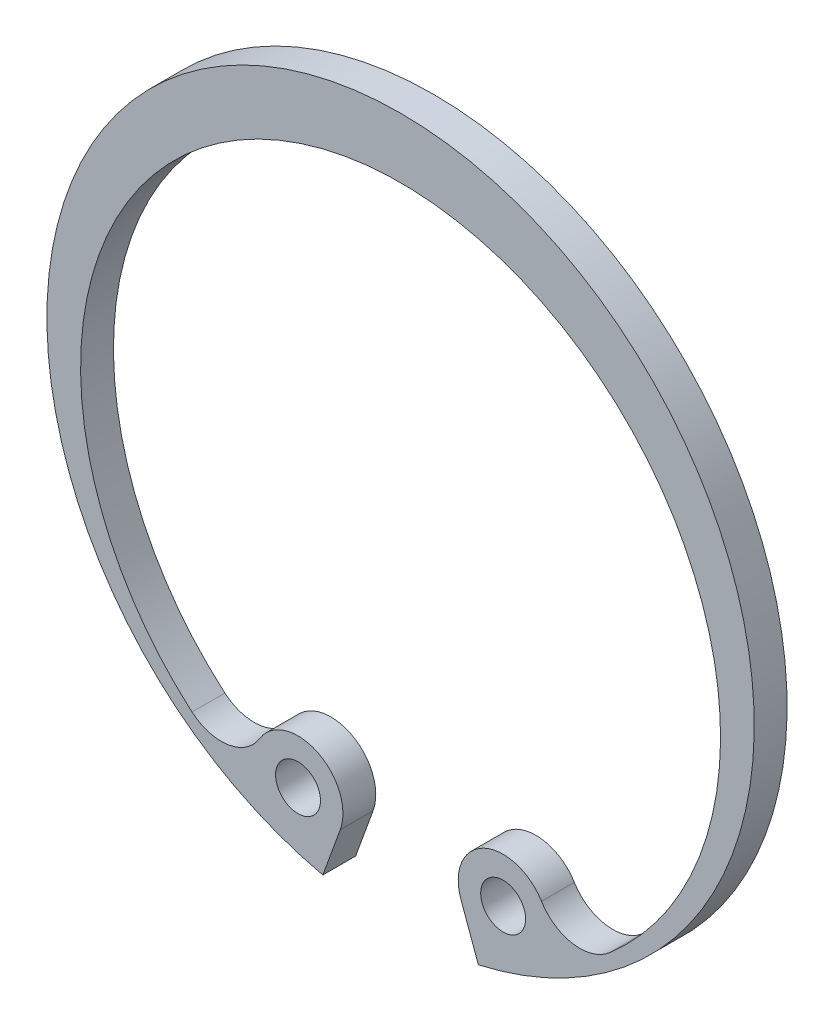
ISO-10303-21;
HEADER;
FILE_DESCRIPTION(('STEP AP214'),'2;1');
FILE_NAME('part.step','',(''),(''),'','','');
FILE_SCHEMA(('AUTOMOTIVE_DESIGN { 1 0 10303 214 1 1 1 1 }'));
ENDSEC;
DATA;
#1=APPLICATION_CONTEXT('core data for automotive mechanical design processes');
#2=APPLICATION_PROTOCOL_DEFINITION('international standard','automotive_design',2000,#1);
#3=PRODUCT_CONTEXT('',#1,'mechanical');
#4=PRODUCT('Part','Part','',(#3));
#5=PRODUCT_RELATED_PRODUCT_CATEGORY('part','',(#4));
#6=PRODUCT_DEFINITION_FORMATION('','',#4);
#7=PRODUCT_DEFINITION_CONTEXT('part definition',#1,'design');
#8=PRODUCT_DEFINITION('design','',#6,#7);
#9=PRODUCT_DEFINITION_SHAPE('','',#8);
#10=(LENGTH_UNIT() NAMED_UNIT(*) SI_UNIT(.MILLI.,.METRE.));
#11=(NAMED_UNIT(*) PLANE_ANGLE_UNIT() SI_UNIT($,.RADIAN.));
#12=(NAMED_UNIT(*) SI_UNIT($,.STERADIAN.) SOLID_ANGLE_UNIT());
#13=UNCERTAINTY_MEASURE_WITH_UNIT(LENGTH_MEASURE(1.E-05),#10,'distance_accuracy_value','');
#14=(GEOMETRIC_REPRESENTATION_CONTEXT(3) GLOBAL_UNCERTAINTY_ASSIGNED_CONTEXT((#13)) GLOBAL_UNIT_ASSIGNED_CONTEXT((#10,
#11,#12)) REPRESENTATION_CONTEXT('',''));
#15=CARTESIAN_POINT('',(0.,0.,0.));
#16=DIRECTION('',(0.,0.,1.));
#17=DIRECTION('',(1.,0.,0.));
#18=AXIS2_PLACEMENT_3D('',#15,#16,#17);
#19=CARTESIAN_POINT('',(0.,0.,0.975));
#20=DIRECTION('',(0.,0.,-1.));
#21=DIRECTION('',(-1.,0.,0.));
#22=AXIS2_PLACEMENT_3D('',#19,#20,#21);
#23=PLANE('',#22);
#24=CARTESIAN_POINT('',(-5.32360078088962,-6.98043795968956,0.975));
#25=DIRECTION('',(0.,0.,-1.));
#26=DIRECTION('',(-1.,0.,0.));
#27=AXIS2_PLACEMENT_3D('',#24,#25,#26);
#28=CIRCLE('',#27,1.33333333333333);
#29=CARTESIAN_POINT('',(-6.19276009205528,-7.99154619800622,0.975));
#30=VERTEX_POINT('',#29);
#31=CARTESIAN_POINT('',(-4.18415582842588,-7.67285617008171,0.975));
#32=VERTEX_POINT('',#31);
#33=EDGE_CURVE('E139',#30,#32,#28,.F.);
#34=ORIENTED_EDGE('',*,*,#33,.T.);
#35=CARTESIAN_POINT('',(-3.04471087596214,-8.36527438047387,0.975));
#36=DIRECTION('',(0.,0.,-1.));
#37=DIRECTION('',(-1.,0.,0.));
#38=AXIS2_PLACEMENT_3D('',#35,#36,#37);
#39=CIRCLE('',#38,1.33333333333333);
#40=CARTESIAN_POINT('',(-1.79178738158093,-8.82130123824143,0.975));
#41=VERTEX_POINT('',#40);
#42=EDGE_CURVE('E95',#41,#32,#39,.F.);
#43=ORIENTED_EDGE('',*,*,#42,.F.);
#44=DIRECTION('',(-0.34202014332567,-0.939692620785908,0.));
#45=VECTOR('',#44,1.);
#46=CARTESIAN_POINT('',(-1.79178738158093,-8.82130123824143,0.975));
#47=LINE('',#46,#45);
#48=CARTESIAN_POINT('',(-2.30921625274565,-10.2429253779404,0.975));
#49=VERTEX_POINT('',#48);
#50=EDGE_CURVE('E92',#41,#49,#47,.T.);
#51=ORIENTED_EDGE('',*,*,#50,.T.);
#52=CARTESIAN_POINT('',(0.,0.,0.975));
#53=DIRECTION('',(0.,0.,-1.));
#54=DIRECTION('',(-1.,0.,0.));
#55=AXIS2_PLACEMENT_3D('',#52,#53,#54);
#56=CIRCLE('',#55,10.5);
#57=CARTESIAN_POINT('',(2.30921625274565,-10.2429253779404,0.975));
#58=VERTEX_POINT('',#57);
#59=EDGE_CURVE('E80',#58,#49,#56,.F.);
#60=ORIENTED_EDGE('',*,*,#59,.F.);
#61=DIRECTION('',(-0.34202014332567,0.939692620785908,0.));
#62=VECTOR('',#61,1.);
#63=CARTESIAN_POINT('',(1.79178738158093,-8.82130123824143,0.975));
#64=LINE('',#63,#62);
#65=CARTESIAN_POINT('',(1.79178738158093,-8.82130123824143,0.975));
#66=VERTEX_POINT('',#65);
#67=EDGE_CURVE('E107',#58,#66,#64,.T.);
#68=ORIENTED_EDGE('',*,*,#67,.T.);
#69=CARTESIAN_POINT('',(3.04471087596214,-8.36527438047387,0.975));
#70=DIRECTION('',(0.,0.,-1.));
#71=DIRECTION('',(-1.,0.,0.));
#72=AXIS2_PLACEMENT_3D('',#69,#70,#71);
#73=CIRCLE('',#72,1.33333333333333);
#74=CARTESIAN_POINT('',(4.18415582842588,-7.67285617008171,0.975));
#75=VERTEX_POINT('',#74);
#76=EDGE_CURVE('E128',#75,#66,#73,.F.);
#77=ORIENTED_EDGE('',*,*,#76,.F.);
#78=CARTESIAN_POINT('',(5.32360078088962,-6.98043795968956,0.975));
#79=DIRECTION('',(0.,0.,-1.));
#80=DIRECTION('',(-1.,0.,0.));
#81=AXIS2_PLACEMENT_3D('',#78,#79,#80);
#82=CIRCLE('',#81,1.33333333333333);
#83=CARTESIAN_POINT('',(6.19276009205528,-7.99154619800622,0.975));
#84=VERTEX_POINT('',#83);
#85=EDGE_CURVE('E132',#75,#84,#82,.F.);
#86=ORIENTED_EDGE('',*,*,#85,.T.);
#87=CARTESIAN_POINT('',(0.,-0.7874,0.975));
#88=DIRECTION('',(0.,0.,-1.));
#89=DIRECTION('',(-1.,0.,0.));
#90=AXIS2_PLACEMENT_3D('',#87,#88,#89);
#91=CIRCLE('',#90,9.5);
#92=EDGE_CURVE('E136',#84,#30,#91,.F.);
#93=ORIENTED_EDGE('',*,*,#92,.T.);
#94=EDGE_LOOP('',(#34,#43,#51,#60,#68,#77,#86,#93));
#95=FACE_BOUND('',#94,.T.);
#96=CARTESIAN_POINT('',(3.04471087596214,-8.36527438047387,0.975));
#97=DIRECTION('',(0.,0.,-1.));
#98=DIRECTION('',(-1.,0.,0.));
#99=AXIS2_PLACEMENT_3D('',#96,#97,#98);
#100=CIRCLE('',#99,0.666666666666667);
#101=CARTESIAN_POINT('',(2.37804420929547,-8.36527438047387,0.975));
#102=VERTEX_POINT('',#101);
#103=EDGE_CURVE('E19',#102,#102,#100,.F.);
#104=ORIENTED_EDGE('',*,*,#103,.T.);
#105=EDGE_LOOP('',(#104));
#106=FACE_BOUND('',#105,.T.);
#107=CARTESIAN_POINT('',(-3.04471087596214,-8.36527438047387,0.975));
#108=DIRECTION('',(0.,0.,-1.));
#109=DIRECTION('',(-1.,0.,0.));
#110=AXIS2_PLACEMENT_3D('',#107,#108,#109);
#111=CIRCLE('',#110,0.666666666666667);
#112=CARTESIAN_POINT('',(-3.71137754262881,-8.36527438047387,0.975));
#113=VERTEX_POINT('',#112);
#114=EDGE_CURVE('E108',#113,#113,#111,.F.);
#115=ORIENTED_EDGE('',*,*,#114,.T.);
#116=EDGE_LOOP('',(#115));
#117=FACE_BOUND('',#116,.T.);
#118=ADVANCED_FACE('F16',(#95,#106,#117),#23,.T.);
#119=CARTESIAN_POINT('',(3.04471087596214,-8.36527438047387,1.95));
#120=DIRECTION('',(0.,0.,-1.));
#121=DIRECTION('',(-1.,0.,0.));
#122=AXIS2_PLACEMENT_3D('',#119,#120,#121);
#123=CYLINDRICAL_SURFACE('',#122,0.666666666666667);
#124=CARTESIAN_POINT('',(3.04471087596214,-8.36527438047387,1.95));
#125=DIRECTION('',(0.,0.,-1.));
#126=DIRECTION('',(-1.,0.,0.));
#127=AXIS2_PLACEMENT_3D('',#124,#125,#126);
#128=CIRCLE('',#127,0.666666666666667);
#129=CARTESIAN_POINT('',(2.37804420929547,-8.36527438047387,1.95));
#130=VERTEX_POINT('',#129);
#131=EDGE_CURVE('E123',#130,#130,#128,.T.);
#132=ORIENTED_EDGE('',*,*,#131,.F.);
#133=EDGE_LOOP('',(#132));
#134=FACE_BOUND('',#133,.T.);
#135=ORIENTED_EDGE('',*,*,#103,.F.);
#136=EDGE_LOOP('',(#135));
#137=FACE_BOUND('',#136,.T.);
#138=ADVANCED_FACE('F264',(#134,#137),#123,.F.);
#139=CARTESIAN_POINT('',(0.,0.,0.975));
#140=DIRECTION('',(0.,0.,-1.));
#141=DIRECTION('',(-1.,0.,0.));
#142=AXIS2_PLACEMENT_3D('',#139,#140,#141);
#143=CYLINDRICAL_SURFACE('',#142,10.5);
#144=ORIENTED_EDGE('',*,*,#59,.T.);
#145=DIRECTION('',(0.,0.,1.));
#146=VECTOR('',#145,1.);
#147=CARTESIAN_POINT('',(-2.30921625274565,-10.2429253779404,1.95));
#148=LINE('',#147,#146);
#149=CARTESIAN_POINT('',(-2.30921625274565,-10.2429253779404,1.95));
#150=VERTEX_POINT('',#149);
#151=EDGE_CURVE('E84',#49,#150,#148,.T.);
#152=ORIENTED_EDGE('',*,*,#151,.T.);
#153=CARTESIAN_POINT('',(0.,0.,1.95));
#154=DIRECTION('',(0.,0.,-1.));
#155=DIRECTION('',(-1.,0.,0.));
#156=AXIS2_PLACEMENT_3D('',#153,#154,#155);
#157=CIRCLE('',#156,10.5);
#158=CARTESIAN_POINT('',(2.30921625274565,-10.2429253779404,1.95));
#159=VERTEX_POINT('',#158);
#160=EDGE_CURVE('E121',#159,#150,#157,.F.);
#161=ORIENTED_EDGE('',*,*,#160,.F.);
#162=DIRECTION('',(0.,0.,1.));
#163=VECTOR('',#162,1.);
#164=CARTESIAN_POINT('',(2.30921625274565,-10.2429253779404,1.95));
#165=LINE('',#164,#163);
#166=EDGE_CURVE('E87',#159,#58,#165,.F.);
#167=ORIENTED_EDGE('',*,*,#166,.T.);
#168=EDGE_LOOP('',(#144,#152,#161,#167));
#169=FACE_BOUND('',#168,.T.);
#170=ADVANCED_FACE('F82',(#169),#143,.T.);
#171=CARTESIAN_POINT('',(-1.79178738158093,-8.82130123824143,1.95));
#172=DIRECTION('',(-0.939692620785908,0.34202014332567,0.));
#173=DIRECTION('',(-0.34202014332567,-0.939692620785908,0.));
#174=AXIS2_PLACEMENT_3D('',#171,#172,#173);
#175=PLANE('',#174);
#176=DIRECTION('',(0.,0.,-1.));
#177=VECTOR('',#176,1.);
#178=CARTESIAN_POINT('',(-1.79178738158093,-8.82130123824143,1.95));
#179=LINE('',#178,#177);
#180=CARTESIAN_POINT('',(-1.79178738158093,-8.82130123824143,1.95));
#181=VERTEX_POINT('',#180);
#182=EDGE_CURVE('E105',#181,#41,#179,.T.);
#183=ORIENTED_EDGE('',*,*,#182,.F.);
#184=DIRECTION('',(0.34202014332567,0.939692620785908,0.));
#185=VECTOR('',#184,1.);
#186=CARTESIAN_POINT('',(-2.30921625274565,-10.2429253779404,1.95));
#187=LINE('',#186,#185);
#188=EDGE_CURVE('E101',#150,#181,#187,.T.);
#189=ORIENTED_EDGE('',*,*,#188,.F.);
#190=ORIENTED_EDGE('',*,*,#151,.F.);
#191=ORIENTED_EDGE('',*,*,#50,.F.);
#192=EDGE_LOOP('',(#183,#189,#190,#191));
#193=FACE_BOUND('',#192,.T.);
#194=ADVANCED_FACE('F99',(#193),#175,.F.);
#195=CARTESIAN_POINT('',(-3.04471087596214,-8.36527438047387,1.95));
#196=DIRECTION('',(0.,0.,-1.));
#197=DIRECTION('',(-1.,0.,0.));
#198=AXIS2_PLACEMENT_3D('',#195,#196,#197);
#199=CYLINDRICAL_SURFACE('',#198,1.33333333333333);
#200=CARTESIAN_POINT('',(-3.04471087596214,-8.36527438047387,1.95));
#201=DIRECTION('',(0.,0.,-1.));
#202=DIRECTION('',(-1.,0.,0.));
#203=AXIS2_PLACEMENT_3D('',#200,#201,#202);
#204=CIRCLE('',#203,1.33333333333333);
#205=CARTESIAN_POINT('',(-4.18415582842588,-7.67285617008171,1.95));
#206=VERTEX_POINT('',#205);
#207=EDGE_CURVE('E118',#181,#206,#204,.F.);
#208=ORIENTED_EDGE('',*,*,#207,.F.);
#209=ORIENTED_EDGE('',*,*,#182,.T.);
#210=ORIENTED_EDGE('',*,*,#42,.T.);
#211=DIRECTION('',(0.,0.,-1.));
#212=VECTOR('',#211,1.);
#213=CARTESIAN_POINT('',(-4.18415582842588,-7.67285617008171,1.95));
#214=LINE('',#213,#212);
#215=EDGE_CURVE('E141',#32,#206,#214,.F.);
#216=ORIENTED_EDGE('',*,*,#215,.T.);
#217=EDGE_LOOP('',(#208,#209,#210,#216));
#218=FACE_BOUND('',#217,.T.);
#219=ADVANCED_FACE('F175',(#218),#199,.T.);
#220=CARTESIAN_POINT('',(-5.32360078088962,-6.98043795968956,1.95));
#221=DIRECTION('',(0.,0.,-1.));
#222=DIRECTION('',(-1.,0.,0.));
#223=AXIS2_PLACEMENT_3D('',#220,#221,#222);
#224=CYLINDRICAL_SURFACE('',#223,1.33333333333333);
#225=DIRECTION('',(0.,0.,-1.));
#226=VECTOR('',#225,1.);
#227=CARTESIAN_POINT('',(-6.19276009205527,-7.99154619800622,1.95));
#228=LINE('',#227,#226);
#229=CARTESIAN_POINT('',(-6.19276009205528,-7.99154619800622,1.95));
#230=VERTEX_POINT('',#229);
#231=EDGE_CURVE('E138',#30,#230,#228,.F.);
#232=ORIENTED_EDGE('',*,*,#231,.T.);
#233=CARTESIAN_POINT('',(-5.32360078088962,-6.98043795968956,1.95));
#234=DIRECTION('',(0.,0.,-1.));
#235=DIRECTION('',(-1.,0.,0.));
#236=AXIS2_PLACEMENT_3D('',#233,#234,#235);
#237=CIRCLE('',#236,1.33333333333333);
#238=EDGE_CURVE('E115',#206,#230,#237,.T.);
#239=ORIENTED_EDGE('',*,*,#238,.F.);
#240=ORIENTED_EDGE('',*,*,#215,.F.);
#241=ORIENTED_EDGE('',*,*,#33,.F.);
#242=EDGE_LOOP('',(#232,#239,#240,#241));
#243=FACE_BOUND('',#242,.T.);
#244=ADVANCED_FACE('F174',(#243),#224,.F.);
#245=CARTESIAN_POINT('',(0.,-0.7874,1.95));
#246=DIRECTION('',(0.,0.,-1.));
#247=DIRECTION('',(-1.,0.,0.));
#248=AXIS2_PLACEMENT_3D('',#245,#246,#247);
#249=CYLINDRICAL_SURFACE('',#248,9.5);
#250=DIRECTION('',(0.,0.,-1.));
#251=VECTOR('',#250,1.);
#252=CARTESIAN_POINT('',(6.19276009205528,-7.99154619800622,1.95));
#253=LINE('',#252,#251);
#254=CARTESIAN_POINT('',(6.19276009205528,-7.99154619800622,1.95));
#255=VERTEX_POINT('',#254);
#256=EDGE_CURVE('E135',#84,#255,#253,.F.);
#257=ORIENTED_EDGE('',*,*,#256,.T.);
#258=CARTESIAN_POINT('',(0.,-0.7874,1.95));
#259=DIRECTION('',(0.,0.,-1.));
#260=DIRECTION('',(-1.,0.,0.));
#261=AXIS2_PLACEMENT_3D('',#258,#259,#260);
#262=CIRCLE('',#261,9.5);
#263=EDGE_CURVE('E113',#230,#255,#262,.T.);
#264=ORIENTED_EDGE('',*,*,#263,.F.);
#265=ORIENTED_EDGE('',*,*,#231,.F.);
#266=ORIENTED_EDGE('',*,*,#92,.F.);
#267=EDGE_LOOP('',(#257,#264,#265,#266));
#268=FACE_BOUND('',#267,.T.);
#269=ADVANCED_FACE('F171',(#268),#249,.F.);
#270=CARTESIAN_POINT('',(5.32360078088962,-6.98043795968956,1.95));
#271=DIRECTION('',(0.,0.,-1.));
#272=DIRECTION('',(-1.,0.,0.));
#273=AXIS2_PLACEMENT_3D('',#270,#271,#272);
#274=CYLINDRICAL_SURFACE('',#273,1.33333333333333);
#275=DIRECTION('',(0.,0.,-1.));
#276=VECTOR('',#275,1.);
#277=CARTESIAN_POINT('',(4.18415582842588,-7.67285617008171,1.95));
#278=LINE('',#277,#276);
#279=CARTESIAN_POINT('',(4.18415582842588,-7.67285617008171,1.95));
#280=VERTEX_POINT('',#279);
#281=EDGE_CURVE('E131',#280,#75,#278,.T.);
#282=ORIENTED_EDGE('',*,*,#281,.F.);
#283=CARTESIAN_POINT('',(5.32360078088962,-6.98043795968956,1.95));
#284=DIRECTION('',(0.,0.,-1.));
#285=DIRECTION('',(-1.,0.,0.));
#286=AXIS2_PLACEMENT_3D('',#283,#284,#285);
#287=CIRCLE('',#286,1.33333333333333);
#288=EDGE_CURVE('E111',#255,#280,#287,.T.);
#289=ORIENTED_EDGE('',*,*,#288,.F.);
#290=ORIENTED_EDGE('',*,*,#256,.F.);
#291=ORIENTED_EDGE('',*,*,#85,.F.);
#292=EDGE_LOOP('',(#282,#289,#290,#291));
#293=FACE_BOUND('',#292,.T.);
#294=ADVANCED_FACE('F165',(#293),#274,.F.);
#295=CARTESIAN_POINT('',(3.04471087596214,-8.36527438047387,1.95));
#296=DIRECTION('',(0.,0.,-1.));
#297=DIRECTION('',(-1.,0.,0.));
#298=AXIS2_PLACEMENT_3D('',#295,#296,#297);
#299=CYLINDRICAL_SURFACE('',#298,1.33333333333333);
#300=ORIENTED_EDGE('',*,*,#76,.T.);
#301=DIRECTION('',(0.,0.,1.));
#302=VECTOR('',#301,1.);
#303=CARTESIAN_POINT('',(1.79178738158093,-8.82130123824143,1.95));
#304=LINE('',#303,#302);
#305=CARTESIAN_POINT('',(1.79178738158093,-8.82130123824143,1.95));
#306=VERTEX_POINT('',#305);
#307=EDGE_CURVE('E130',#66,#306,#304,.T.);
#308=ORIENTED_EDGE('',*,*,#307,.T.);
#309=CARTESIAN_POINT('',(3.04471087596214,-8.36527438047387,1.95));
#310=DIRECTION('',(0.,0.,-1.));
#311=DIRECTION('',(-1.,0.,0.));
#312=AXIS2_PLACEMENT_3D('',#309,#310,#311);
#313=CIRCLE('',#312,1.33333333333333);
#314=EDGE_CURVE('E34',#280,#306,#313,.F.);
#315=ORIENTED_EDGE('',*,*,#314,.F.);
#316=ORIENTED_EDGE('',*,*,#281,.T.);
#317=EDGE_LOOP('',(#300,#308,#315,#316));
#318=FACE_BOUND('',#317,.T.);
#319=ADVANCED_FACE('F167',(#318),#299,.T.);
#320=CARTESIAN_POINT('',(1.79178738158093,-8.82130123824143,1.95));
#321=DIRECTION('',(0.939692620785908,0.34202014332567,0.));
#322=DIRECTION('',(-0.34202014332567,0.939692620785908,0.));
#323=AXIS2_PLACEMENT_3D('',#320,#321,#322);
#324=PLANE('',#323);
#325=ORIENTED_EDGE('',*,*,#166,.F.);
#326=DIRECTION('',(0.34202014332567,-0.939692620785908,0.));
#327=VECTOR('',#326,1.);
#328=CARTESIAN_POINT('',(1.79178738158093,-8.82130123824143,1.95));
#329=LINE('',#328,#327);
#330=EDGE_CURVE('E25',#306,#159,#329,.T.);
#331=ORIENTED_EDGE('',*,*,#330,.F.);
#332=ORIENTED_EDGE('',*,*,#307,.F.);
#333=ORIENTED_EDGE('',*,*,#67,.F.);
#334=EDGE_LOOP('',(#325,#331,#332,#333));
#335=FACE_BOUND('',#334,.T.);
#336=ADVANCED_FACE('F160',(#335),#324,.F.);
#337=CARTESIAN_POINT('',(-3.04471087596214,-8.36527438047387,1.95));
#338=DIRECTION('',(0.,0.,-1.));
#339=DIRECTION('',(-1.,0.,0.));
#340=AXIS2_PLACEMENT_3D('',#337,#338,#339);
#341=CYLINDRICAL_SURFACE('',#340,0.666666666666667);
#342=CARTESIAN_POINT('',(-3.04471087596214,-8.36527438047387,1.95));
#343=DIRECTION('',(0.,0.,-1.));
#344=DIRECTION('',(-1.,0.,0.));
#345=AXIS2_PLACEMENT_3D('',#342,#343,#344);
#346=CIRCLE('',#345,0.666666666666667);
#347=CARTESIAN_POINT('',(-3.71137754262881,-8.36527438047387,1.95));
#348=VERTEX_POINT('',#347);
#349=EDGE_CURVE('E11',#348,#348,#346,.T.);
#350=ORIENTED_EDGE('',*,*,#349,.F.);
#351=EDGE_LOOP('',(#350));
#352=FACE_BOUND('',#351,.T.);
#353=ORIENTED_EDGE('',*,*,#114,.F.);
#354=EDGE_LOOP('',(#353));
#355=FACE_BOUND('',#354,.T.);
#356=ADVANCED_FACE('F186',(#352,#355),#341,.F.);
#357=CARTESIAN_POINT('',(0.,0.,1.95));
#358=DIRECTION('',(0.,0.,1.));
#359=DIRECTION('',(1.,0.,0.));
#360=AXIS2_PLACEMENT_3D('',#357,#358,#359);
#361=PLANE('',#360);
#362=ORIENTED_EDGE('',*,*,#349,.T.);
#363=EDGE_LOOP('',(#362));
#364=FACE_BOUND('',#363,.T.);
#365=ORIENTED_EDGE('',*,*,#314,.T.);
#366=ORIENTED_EDGE('',*,*,#330,.T.);
#367=ORIENTED_EDGE('',*,*,#160,.T.);
#368=ORIENTED_EDGE('',*,*,#188,.T.);
#369=ORIENTED_EDGE('',*,*,#207,.T.);
#370=ORIENTED_EDGE('',*,*,#238,.T.);
#371=ORIENTED_EDGE('',*,*,#263,.T.);
#372=ORIENTED_EDGE('',*,*,#288,.T.);
#373=EDGE_LOOP('',(#365,#366,#367,#368,#369,#370,#371,#372));
#374=FACE_BOUND('',#373,.T.);
#375=ORIENTED_EDGE('',*,*,#131,.T.);
#376=EDGE_LOOP('',(#375));
#377=FACE_BOUND('',#376,.T.);
#378=ADVANCED_FACE('F156',(#364,#374,#377),#361,.T.);
#379=CLOSED_SHELL('',(#118,#138,#170,#194,#219,#244,#269,#294,#319,#336,#356,#378));
#380=MANIFOLD_SOLID_BREP('B1',#379);
#381=ADVANCED_BREP_SHAPE_REPRESENTATION('',(#18,#380),#14);
#382=SHAPE_DEFINITION_REPRESENTATION(#9,#381);
ENDSEC;
END-ISO-10303-21;
